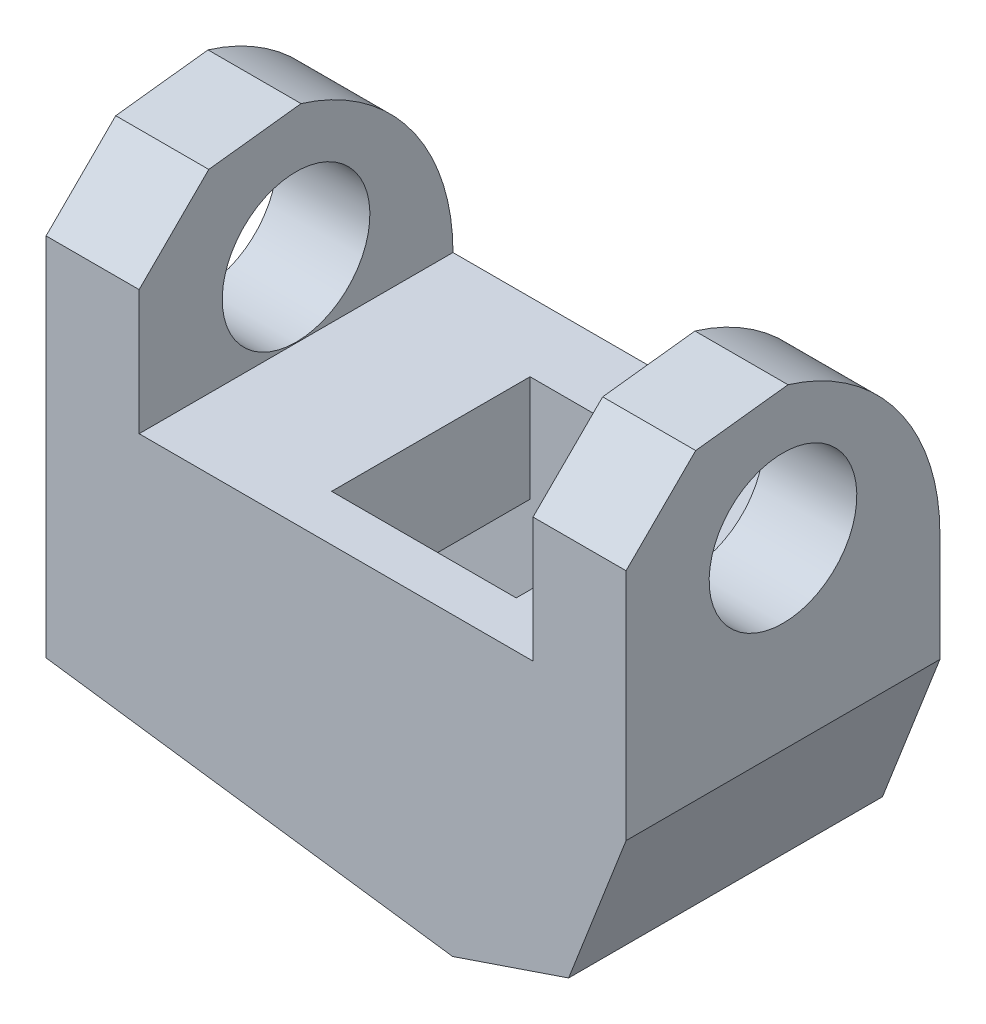
ISO-10303-21;
HEADER;
FILE_DESCRIPTION(('STEP AP214'),'2;1');
FILE_NAME('part.step','',(''),(''),'','','');
FILE_SCHEMA(('AUTOMOTIVE_DESIGN { 1 0 10303 214 1 1 1 1 }'));
ENDSEC;
DATA;
#1=APPLICATION_CONTEXT('core data for automotive mechanical design processes');
#2=APPLICATION_PROTOCOL_DEFINITION('international standard','automotive_design',2000,#1);
#3=PRODUCT_CONTEXT('',#1,'mechanical');
#4=PRODUCT('Part','Part','',(#3));
#5=PRODUCT_RELATED_PRODUCT_CATEGORY('part','',(#4));
#6=PRODUCT_DEFINITION_FORMATION('','',#4);
#7=PRODUCT_DEFINITION_CONTEXT('part definition',#1,'design');
#8=PRODUCT_DEFINITION('design','',#6,#7);
#9=PRODUCT_DEFINITION_SHAPE('','',#8);
#10=(LENGTH_UNIT() NAMED_UNIT(*) SI_UNIT(.MILLI.,.METRE.));
#11=(NAMED_UNIT(*) PLANE_ANGLE_UNIT() SI_UNIT($,.RADIAN.));
#12=(NAMED_UNIT(*) SI_UNIT($,.STERADIAN.) SOLID_ANGLE_UNIT());
#13=UNCERTAINTY_MEASURE_WITH_UNIT(LENGTH_MEASURE(1.E-05),#10,'distance_accuracy_value','');
#14=(GEOMETRIC_REPRESENTATION_CONTEXT(3) GLOBAL_UNCERTAINTY_ASSIGNED_CONTEXT((#13)) GLOBAL_UNIT_ASSIGNED_CONTEXT((#10,
#11,#12)) REPRESENTATION_CONTEXT('',''));
#15=CARTESIAN_POINT('',(0.,0.,0.));
#16=DIRECTION('',(0.,0.,1.));
#17=DIRECTION('',(1.,0.,0.));
#18=AXIS2_PLACEMENT_3D('',#15,#16,#17);
#19=CARTESIAN_POINT('',(-4.35864591467142,-16.034358049613,17.));
#20=DIRECTION('',(0.134895900916506,0.990859776111597,0.));
#21=DIRECTION('',(-0.990859776111597,0.134895900916506,0.));
#22=AXIS2_PLACEMENT_3D('',#19,#20,#21);
#23=PLANE('',#22);
#24=DIRECTION('',(0.990859776111597,-0.134895900916506,0.));
#25=VECTOR('',#24,1.);
#26=CARTESIAN_POINT('',(-4.35864591467142,-16.034358049613,0.));
#27=LINE('',#26,#25);
#28=CARTESIAN_POINT('',(-26.3755501398711,-13.0369711312482,0.));
#29=VERTEX_POINT('',#28);
#30=CARTESIAN_POINT('',(-4.35864591467142,-16.034358049613,0.));
#31=VERTEX_POINT('',#30);
#32=EDGE_CURVE('E285',#29,#31,#27,.T.);
#33=ORIENTED_EDGE('',*,*,#32,.T.);
#34=DIRECTION('',(0.,0.,-1.));
#35=VECTOR('',#34,1.);
#36=CARTESIAN_POINT('',(-4.35864591467142,-16.034358049613,17.));
#37=LINE('',#36,#35);
#38=CARTESIAN_POINT('',(-4.35864591467142,-16.034358049613,17.));
#39=VERTEX_POINT('',#38);
#40=EDGE_CURVE('E301',#39,#31,#37,.T.);
#41=ORIENTED_EDGE('',*,*,#40,.F.);
#42=DIRECTION('',(0.990859776111597,-0.134895900916506,0.));
#43=VECTOR('',#42,1.);
#44=CARTESIAN_POINT('',(-4.35864591467142,-16.034358049613,17.));
#45=LINE('',#44,#43);
#46=CARTESIAN_POINT('',(-26.3755501398711,-13.0369711312482,17.));
#47=VERTEX_POINT('',#46);
#48=EDGE_CURVE('E269',#47,#39,#45,.T.);
#49=ORIENTED_EDGE('',*,*,#48,.F.);
#50=DIRECTION('',(0.,0.,-1.));
#51=VECTOR('',#50,1.);
#52=CARTESIAN_POINT('',(-26.3755501398711,-13.0369711312482,17.));
#53=LINE('',#52,#51);
#54=EDGE_CURVE('E304',#47,#29,#53,.T.);
#55=ORIENTED_EDGE('',*,*,#54,.T.);
#56=EDGE_LOOP('',(#33,#41,#49,#55));
#57=FACE_BOUND('',#56,.T.);
#58=DIRECTION('',(-0.990859776111597,0.134895900916506,0.));
#59=VECTOR('',#58,1.);
#60=CARTESIAN_POINT('',(-20.9013469365187,-13.782230542034,3.74));
#61=LINE('',#60,#59);
#62=CARTESIAN_POINT('',(-8.3419022146401,-15.4920765279286,3.74));
#63=VERTEX_POINT('',#62);
#64=CARTESIAN_POINT('',(-20.6979236227517,-13.8099246434998,3.74));
#65=VERTEX_POINT('',#64);
#66=EDGE_CURVE('E208',#63,#65,#61,.T.);
#67=ORIENTED_EDGE('',*,*,#66,.T.);
#68=DIRECTION('',(0.,0.,1.));
#69=VECTOR('',#68,1.);
#70=CARTESIAN_POINT('',(-20.6979236227517,-13.8099246434998,3.74));
#71=LINE('',#70,#69);
#72=CARTESIAN_POINT('',(-20.6979236227517,-13.8099246434998,14.49));
#73=VERTEX_POINT('',#72);
#74=EDGE_CURVE('E204',#65,#73,#71,.T.);
#75=ORIENTED_EDGE('',*,*,#74,.T.);
#76=DIRECTION('',(0.990859776111597,-0.134895900916506,0.));
#77=VECTOR('',#76,1.);
#78=CARTESIAN_POINT('',(-20.9013469365187,-13.782230542034,14.49));
#79=LINE('',#78,#77);
#80=CARTESIAN_POINT('',(-8.3419022146401,-15.4920765279286,14.49));
#81=VERTEX_POINT('',#80);
#82=EDGE_CURVE('E207',#73,#81,#79,.T.);
#83=ORIENTED_EDGE('',*,*,#82,.T.);
#84=DIRECTION('',(0.,0.,-1.));
#85=VECTOR('',#84,1.);
#86=CARTESIAN_POINT('',(-8.3419022146401,-15.4920765279286,3.74));
#87=LINE('',#86,#85);
#88=EDGE_CURVE('E210',#81,#63,#87,.T.);
#89=ORIENTED_EDGE('',*,*,#88,.T.);
#90=EDGE_LOOP('',(#67,#75,#83,#89));
#91=FACE_BOUND('',#90,.T.);
#92=ADVANCED_FACE('F32',(#57,#91),#23,.F.);
#93=CARTESIAN_POINT('',(-21.3355501398711,11.1,17.));
#94=DIRECTION('',(-1.,0.,0.));
#95=DIRECTION('',(0.,-1.,0.));
#96=AXIS2_PLACEMENT_3D('',#93,#94,#95);
#97=PLANE('',#96);
#98=CARTESIAN_POINT('',(-21.3355501398711,4.04162085133609,8.5));
#99=DIRECTION('',(-1.,0.,0.));
#100=DIRECTION('',(0.,-1.,0.));
#101=AXIS2_PLACEMENT_3D('',#98,#99,#100);
#102=CIRCLE('',#101,4.);
#103=CARTESIAN_POINT('',(-21.3355501398711,0.0416208513360841,8.5));
#104=VERTEX_POINT('',#103);
#105=EDGE_CURVE('E415',#104,#104,#102,.T.);
#106=ORIENTED_EDGE('',*,*,#105,.T.);
#107=EDGE_LOOP('',(#106));
#108=FACE_BOUND('',#107,.T.);
#109=DIRECTION('',(0.,0.705253158861616,-0.708955557080775));
#110=VECTOR('',#109,1.);
#111=CARTESIAN_POINT('',(-21.3355501398711,8.91863795848581,14.8300297458231));
#112=LINE('',#111,#110);
#113=CARTESIAN_POINT('',(-21.3355501398711,6.76,17.));
#114=VERTEX_POINT('',#113);
#115=CARTESIAN_POINT('',(-21.3355501398711,10.5122475955982,13.2280540668032));
#116=VERTEX_POINT('',#115);
#117=EDGE_CURVE('E251',#114,#116,#112,.T.);
#118=ORIENTED_EDGE('',*,*,#117,.F.);
#119=DIRECTION('',(0.,1.,0.));
#120=VECTOR('',#119,1.);
#121=CARTESIAN_POINT('',(-21.3355501398711,11.1,17.));
#122=LINE('',#121,#120);
#123=CARTESIAN_POINT('',(-21.3355501398711,0.,17.));
#124=VERTEX_POINT('',#123);
#125=EDGE_CURVE('E263',#124,#114,#122,.T.);
#126=ORIENTED_EDGE('',*,*,#125,.F.);
#127=DIRECTION('',(0.,0.,-1.));
#128=VECTOR('',#127,1.);
#129=CARTESIAN_POINT('',(-21.3355501398711,0.,17.));
#130=LINE('',#129,#128);
#131=CARTESIAN_POINT('',(-21.3355501398711,0.,0.));
#132=VERTEX_POINT('',#131);
#133=EDGE_CURVE('E307',#124,#132,#130,.T.);
#134=ORIENTED_EDGE('',*,*,#133,.T.);
#135=CARTESIAN_POINT('',(-21.3355501398711,0.,11.6012165316514));
#136=DIRECTION('',(-1.,0.,0.));
#137=DIRECTION('',(0.,-1.,0.));
#138=AXIS2_PLACEMENT_3D('',#135,#136,#137);
#139=CIRCLE('',#138,11.6012165316514);
#140=CARTESIAN_POINT('',(-21.3355501398711,11.1,8.22805406680315));
#141=VERTEX_POINT('',#140);
#142=EDGE_CURVE('E243',#141,#132,#139,.T.);
#143=ORIENTED_EDGE('',*,*,#142,.F.);
#144=DIRECTION('',(0.,0.116746638974287,-0.993161730177018));
#145=VECTOR('',#144,1.);
#146=CARTESIAN_POINT('',(-21.3355501398711,10.0829078343711,16.8804403268307));
#147=LINE('',#146,#145);
#148=EDGE_CURVE('E257',#116,#141,#147,.T.);
#149=ORIENTED_EDGE('',*,*,#148,.F.);
#150=EDGE_LOOP('',(#118,#126,#134,#143,#149));
#151=FACE_BOUND('',#150,.T.);
#152=ADVANCED_FACE('F345',(#108,#151),#97,.F.);
#153=CARTESIAN_POINT('',(-26.3755501398711,-13.0369711312482,17.));
#154=DIRECTION('',(1.,0.,0.));
#155=DIRECTION('',(0.,1.,0.));
#156=AXIS2_PLACEMENT_3D('',#153,#154,#155);
#157=PLANE('',#156);
#158=CARTESIAN_POINT('',(-26.3755501398711,4.04162085133609,8.5));
#159=DIRECTION('',(1.,0.,0.));
#160=DIRECTION('',(0.,1.,0.));
#161=AXIS2_PLACEMENT_3D('',#158,#159,#160);
#162=CIRCLE('',#161,4.);
#163=CARTESIAN_POINT('',(-26.3755501398711,8.04162085133609,8.5));
#164=VERTEX_POINT('',#163);
#165=EDGE_CURVE('E413',#164,#164,#162,.T.);
#166=ORIENTED_EDGE('',*,*,#165,.T.);
#167=EDGE_LOOP('',(#166));
#168=FACE_BOUND('',#167,.T.);
#169=DIRECTION('',(0.,-0.705253158861616,0.708955557080775));
#170=VECTOR('',#169,1.);
#171=CARTESIAN_POINT('',(-26.3755501398711,-3.08665745321663,26.8983498796331));
#172=LINE('',#171,#170);
#173=CARTESIAN_POINT('',(-26.3755501398711,10.5122475955982,13.2280540668032));
#174=VERTEX_POINT('',#173);
#175=CARTESIAN_POINT('',(-26.3755501398711,6.76,17.));
#176=VERTEX_POINT('',#175);
#177=EDGE_CURVE('E249',#174,#176,#172,.T.);
#178=ORIENTED_EDGE('',*,*,#177,.F.);
#179=DIRECTION('',(0.,-0.116746638974287,0.993161730177018));
#180=VECTOR('',#179,1.);
#181=CARTESIAN_POINT('',(-26.3755501398711,9.75392628321622,19.6790809507654));
#182=LINE('',#181,#180);
#183=CARTESIAN_POINT('',(-26.3755501398711,11.1,8.22805406680315));
#184=VERTEX_POINT('',#183);
#185=EDGE_CURVE('E255',#184,#174,#182,.T.);
#186=ORIENTED_EDGE('',*,*,#185,.F.);
#187=CARTESIAN_POINT('',(-26.3755501398711,0.,11.6012165316514));
#188=DIRECTION('',(1.,0.,0.));
#189=DIRECTION('',(0.,1.,0.));
#190=AXIS2_PLACEMENT_3D('',#187,#188,#189);
#191=CIRCLE('',#190,11.6012165316514);
#192=CARTESIAN_POINT('',(-26.3755501398711,0.,0.));
#193=VERTEX_POINT('',#192);
#194=EDGE_CURVE('E241',#193,#184,#191,.T.);
#195=ORIENTED_EDGE('',*,*,#194,.F.);
#196=DIRECTION('',(0.,-1.,0.));
#197=VECTOR('',#196,1.);
#198=CARTESIAN_POINT('',(-26.3755501398711,-13.0369711312482,0.));
#199=LINE('',#198,#197);
#200=EDGE_CURVE('E283',#193,#29,#199,.T.);
#201=ORIENTED_EDGE('',*,*,#200,.T.);
#202=ORIENTED_EDGE('',*,*,#54,.F.);
#203=DIRECTION('',(0.,-1.,0.));
#204=VECTOR('',#203,1.);
#205=CARTESIAN_POINT('',(-26.3755501398711,-13.0369711312482,17.));
#206=LINE('',#205,#204);
#207=EDGE_CURVE('E267',#176,#47,#206,.T.);
#208=ORIENTED_EDGE('',*,*,#207,.F.);
#209=EDGE_LOOP('',(#178,#186,#195,#201,#202,#208));
#210=FACE_BOUND('',#209,.T.);
#211=ADVANCED_FACE('F376',(#168,#210),#157,.F.);
#212=CARTESIAN_POINT('',(5.04,11.1,17.));
#213=DIRECTION('',(-1.,0.,0.));
#214=DIRECTION('',(0.,-1.,0.));
#215=AXIS2_PLACEMENT_3D('',#212,#213,#214);
#216=PLANE('',#215);
#217=CARTESIAN_POINT('',(5.04,4.04162085133608,8.5));
#218=DIRECTION('',(-1.,0.,0.));
#219=DIRECTION('',(0.,-1.,0.));
#220=AXIS2_PLACEMENT_3D('',#217,#218,#219);
#221=CIRCLE('',#220,4.);
#222=CARTESIAN_POINT('',(5.04,0.0416208513360763,8.5));
#223=VERTEX_POINT('',#222);
#224=EDGE_CURVE('E416',#223,#223,#221,.T.);
#225=ORIENTED_EDGE('',*,*,#224,.T.);
#226=EDGE_LOOP('',(#225));
#227=FACE_BOUND('',#226,.T.);
#228=DIRECTION('',(0.,0.705253158861616,-0.708955557080775));
#229=VECTOR('',#228,1.);
#230=CARTESIAN_POINT('',(5.04,8.91863795848581,14.8300297458231));
#231=LINE('',#230,#229);
#232=CARTESIAN_POINT('',(5.04,6.76,17.));
#233=VERTEX_POINT('',#232);
#234=CARTESIAN_POINT('',(5.04,10.5122475955982,13.2280540668032));
#235=VERTEX_POINT('',#234);
#236=EDGE_CURVE('E247',#233,#235,#231,.T.);
#237=ORIENTED_EDGE('',*,*,#236,.F.);
#238=DIRECTION('',(0.,1.,0.));
#239=VECTOR('',#238,1.);
#240=CARTESIAN_POINT('',(5.04,11.1,17.));
#241=LINE('',#240,#239);
#242=CARTESIAN_POINT('',(5.04,-5.9,17.));
#243=VERTEX_POINT('',#242);
#244=EDGE_CURVE('E275',#243,#233,#241,.T.);
#245=ORIENTED_EDGE('',*,*,#244,.F.);
#246=DIRECTION('',(0.,0.,-1.));
#247=VECTOR('',#246,1.);
#248=CARTESIAN_POINT('',(5.04,-5.9,17.));
#249=LINE('',#248,#247);
#250=CARTESIAN_POINT('',(5.04,-5.9,0.));
#251=VERTEX_POINT('',#250);
#252=EDGE_CURVE('E295',#243,#251,#249,.T.);
#253=ORIENTED_EDGE('',*,*,#252,.T.);
#254=DIRECTION('',(0.,1.,0.));
#255=VECTOR('',#254,1.);
#256=CARTESIAN_POINT('',(5.04,11.1,0.));
#257=LINE('',#256,#255);
#258=CARTESIAN_POINT('',(5.04,0.,0.));
#259=VERTEX_POINT('',#258);
#260=EDGE_CURVE('E264',#251,#259,#257,.T.);
#261=ORIENTED_EDGE('',*,*,#260,.T.);
#262=CARTESIAN_POINT('',(5.04,0.,11.6012165316514));
#263=DIRECTION('',(-1.,0.,0.));
#264=DIRECTION('',(0.,-1.,0.));
#265=AXIS2_PLACEMENT_3D('',#262,#263,#264);
#266=CIRCLE('',#265,11.6012165316514);
#267=CARTESIAN_POINT('',(5.04,11.1,8.22805406680315));
#268=VERTEX_POINT('',#267);
#269=EDGE_CURVE('E239',#268,#259,#266,.T.);
#270=ORIENTED_EDGE('',*,*,#269,.F.);
#271=DIRECTION('',(0.,0.116746638974287,-0.993161730177018));
#272=VECTOR('',#271,1.);
#273=CARTESIAN_POINT('',(5.04,10.0829078343711,16.8804403268307));
#274=LINE('',#273,#272);
#275=EDGE_CURVE('E253',#235,#268,#274,.T.);
#276=ORIENTED_EDGE('',*,*,#275,.F.);
#277=EDGE_LOOP('',(#237,#245,#253,#261,#270,#276));
#278=FACE_BOUND('',#277,.T.);
#279=ADVANCED_FACE('F357',(#227,#278),#216,.F.);
#280=CARTESIAN_POINT('',(0.,0.,17.));
#281=DIRECTION('',(1.,0.,0.));
#282=DIRECTION('',(0.,0.,-1.));
#283=AXIS2_PLACEMENT_3D('',#280,#281,#282);
#284=PLANE('',#283);
#285=CARTESIAN_POINT('',(0.,4.04162085133608,8.5));
#286=DIRECTION('',(1.,0.,0.));
#287=DIRECTION('',(0.,0.,-1.));
#288=AXIS2_PLACEMENT_3D('',#285,#286,#287);
#289=CIRCLE('',#288,4.);
#290=CARTESIAN_POINT('',(0.,4.04162085133608,4.5));
#291=VERTEX_POINT('',#290);
#292=EDGE_CURVE('E36',#291,#291,#289,.T.);
#293=ORIENTED_EDGE('',*,*,#292,.T.);
#294=EDGE_LOOP('',(#293));
#295=FACE_BOUND('',#294,.T.);
#296=DIRECTION('',(0.,-0.705253158861616,0.708955557080775));
#297=VECTOR('',#296,1.);
#298=CARTESIAN_POINT('',(0.,3.39769755775021,20.3799536677963));
#299=LINE('',#298,#297);
#300=CARTESIAN_POINT('',(0.,10.5122475955982,13.2280540668032));
#301=VERTEX_POINT('',#300);
#302=CARTESIAN_POINT('',(0.,6.76,17.));
#303=VERTEX_POINT('',#302);
#304=EDGE_CURVE('E245',#301,#303,#299,.T.);
#305=ORIENTED_EDGE('',*,*,#304,.F.);
#306=DIRECTION('',(0.,-0.116746638974287,0.993161730177018));
#307=VECTOR('',#306,1.);
#308=CARTESIAN_POINT('',(0.,9.93161730177018,18.1674663897429));
#309=LINE('',#308,#307);
#310=CARTESIAN_POINT('',(0.,11.1,8.22805406680315));
#311=VERTEX_POINT('',#310);
#312=EDGE_CURVE('E11',#311,#301,#309,.T.);
#313=ORIENTED_EDGE('',*,*,#312,.F.);
#314=CARTESIAN_POINT('',(0.,0.,11.6012165316514));
#315=DIRECTION('',(1.,0.,0.));
#316=DIRECTION('',(0.,0.,-1.));
#317=AXIS2_PLACEMENT_3D('',#314,#315,#316);
#318=CIRCLE('',#317,11.6012165316514);
#319=CARTESIAN_POINT('',(0.,0.,0.));
#320=VERTEX_POINT('',#319);
#321=EDGE_CURVE('E237',#320,#311,#318,.T.);
#322=ORIENTED_EDGE('',*,*,#321,.F.);
#323=DIRECTION('',(0.,0.,-1.));
#324=VECTOR('',#323,1.);
#325=CARTESIAN_POINT('',(0.,0.,17.));
#326=LINE('',#325,#324);
#327=CARTESIAN_POINT('',(0.,0.,17.));
#328=VERTEX_POINT('',#327);
#329=EDGE_CURVE('E280',#328,#320,#326,.T.);
#330=ORIENTED_EDGE('',*,*,#329,.F.);
#331=DIRECTION('',(0.,-1.,0.));
#332=VECTOR('',#331,1.);
#333=CARTESIAN_POINT('',(0.,0.,17.));
#334=LINE('',#333,#332);
#335=EDGE_CURVE('E278',#303,#328,#334,.T.);
#336=ORIENTED_EDGE('',*,*,#335,.F.);
#337=EDGE_LOOP('',(#305,#313,#322,#330,#336));
#338=FACE_BOUND('',#337,.T.);
#339=ADVANCED_FACE('F332',(#295,#338),#284,.F.);
#340=CARTESIAN_POINT('',(0.,0.,17.));
#341=DIRECTION('',(0.,0.,1.));
#342=DIRECTION('',(1.,0.,0.));
#343=AXIS2_PLACEMENT_3D('',#340,#341,#342);
#344=PLANE('',#343);
#345=ORIENTED_EDGE('',*,*,#244,.T.);
#346=DIRECTION('',(-1.,0.,0.));
#347=VECTOR('',#346,1.);
#348=CARTESIAN_POINT('',(0.,6.76,17.));
#349=LINE('',#348,#347);
#350=EDGE_CURVE('E41',#233,#303,#349,.T.);
#351=ORIENTED_EDGE('',*,*,#350,.T.);
#352=ORIENTED_EDGE('',*,*,#335,.T.);
#353=DIRECTION('',(-1.,0.,0.));
#354=VECTOR('',#353,1.);
#355=CARTESIAN_POINT('',(-21.3355501398711,0.,17.));
#356=LINE('',#355,#354);
#357=EDGE_CURVE('E260',#328,#124,#356,.T.);
#358=ORIENTED_EDGE('',*,*,#357,.T.);
#359=ORIENTED_EDGE('',*,*,#125,.T.);
#360=EDGE_CURVE('E313',#114,#176,#349,.T.);
#361=ORIENTED_EDGE('',*,*,#360,.T.);
#362=ORIENTED_EDGE('',*,*,#207,.T.);
#363=ORIENTED_EDGE('',*,*,#48,.T.);
#364=DIRECTION('',(0.946930129495106,0.321439465303159,0.));
#365=VECTOR('',#364,1.);
#366=CARTESIAN_POINT('',(1.92897014517608,-13.9,17.));
#367=LINE('',#366,#365);
#368=CARTESIAN_POINT('',(1.92897014517608,-13.9,17.));
#369=VERTEX_POINT('',#368);
#370=EDGE_CURVE('E271',#39,#369,#367,.T.);
#371=ORIENTED_EDGE('',*,*,#370,.T.);
#372=DIRECTION('',(0.362438038283702,0.932007869282798,0.));
#373=VECTOR('',#372,1.);
#374=CARTESIAN_POINT('',(5.04,-5.9,17.));
#375=LINE('',#374,#373);
#376=EDGE_CURVE('E273',#369,#243,#375,.T.);
#377=ORIENTED_EDGE('',*,*,#376,.T.);
#378=EDGE_LOOP('',(#345,#351,#352,#358,#359,#361,#362,#363,#371,#377));
#379=FACE_BOUND('',#378,.T.);
#380=ADVANCED_FACE('F347',(#379),#344,.T.);
#381=CARTESIAN_POINT('',(0.,0.,0.));
#382=DIRECTION('',(0.,0.,1.));
#383=DIRECTION('',(1.,0.,0.));
#384=AXIS2_PLACEMENT_3D('',#381,#382,#383);
#385=PLANE('',#384);
#386=DIRECTION('',(-1.,0.,0.));
#387=VECTOR('',#386,1.);
#388=CARTESIAN_POINT('',(31.,0.,0.));
#389=LINE('',#388,#387);
#390=EDGE_CURVE('E312',#259,#320,#389,.T.);
#391=ORIENTED_EDGE('',*,*,#390,.F.);
#392=ORIENTED_EDGE('',*,*,#260,.F.);
#393=DIRECTION('',(0.362438038283702,0.932007869282798,0.));
#394=VECTOR('',#393,1.);
#395=CARTESIAN_POINT('',(5.04,-5.9,0.));
#396=LINE('',#395,#394);
#397=CARTESIAN_POINT('',(1.92897014517608,-13.9,0.));
#398=VERTEX_POINT('',#397);
#399=EDGE_CURVE('E289',#398,#251,#396,.T.);
#400=ORIENTED_EDGE('',*,*,#399,.F.);
#401=DIRECTION('',(0.946930129495106,0.321439465303159,0.));
#402=VECTOR('',#401,1.);
#403=CARTESIAN_POINT('',(1.92897014517608,-13.9,0.));
#404=LINE('',#403,#402);
#405=EDGE_CURVE('E287',#31,#398,#404,.T.);
#406=ORIENTED_EDGE('',*,*,#405,.F.);
#407=ORIENTED_EDGE('',*,*,#32,.F.);
#408=ORIENTED_EDGE('',*,*,#200,.F.);
#409=EDGE_CURVE('E310',#132,#193,#389,.T.);
#410=ORIENTED_EDGE('',*,*,#409,.F.);
#411=DIRECTION('',(-1.,0.,0.));
#412=VECTOR('',#411,1.);
#413=CARTESIAN_POINT('',(-21.3355501398711,0.,0.));
#414=LINE('',#413,#412);
#415=EDGE_CURVE('E259',#320,#132,#414,.T.);
#416=ORIENTED_EDGE('',*,*,#415,.F.);
#417=EDGE_LOOP('',(#391,#392,#400,#406,#407,#408,#410,#416));
#418=FACE_BOUND('',#417,.T.);
#419=ADVANCED_FACE('F337',(#418),#385,.F.);
#420=CARTESIAN_POINT('',(-21.3355501398711,0.,17.));
#421=DIRECTION('',(0.,-1.,0.));
#422=DIRECTION('',(0.,0.,-1.));
#423=AXIS2_PLACEMENT_3D('',#420,#421,#422);
#424=PLANE('',#423);
#425=DIRECTION('',(-1.,0.,0.));
#426=VECTOR('',#425,1.);
#427=CARTESIAN_POINT('',(-3.42,0.,3.74));
#428=LINE('',#427,#426);
#429=CARTESIAN_POINT('',(-3.42,0.,3.74));
#430=VERTEX_POINT('',#429);
#431=CARTESIAN_POINT('',(-13.42,0.,3.74));
#432=VERTEX_POINT('',#431);
#433=EDGE_CURVE('E186',#430,#432,#428,.T.);
#434=ORIENTED_EDGE('',*,*,#433,.F.);
#435=DIRECTION('',(0.,0.,-1.));
#436=VECTOR('',#435,1.);
#437=CARTESIAN_POINT('',(-3.42,0.,14.49));
#438=LINE('',#437,#436);
#439=CARTESIAN_POINT('',(-3.42,0.,14.49));
#440=VERTEX_POINT('',#439);
#441=EDGE_CURVE('E48',#440,#430,#438,.T.);
#442=ORIENTED_EDGE('',*,*,#441,.F.);
#443=DIRECTION('',(1.,0.,0.));
#444=VECTOR('',#443,1.);
#445=CARTESIAN_POINT('',(-3.42,0.,14.49));
#446=LINE('',#445,#444);
#447=CARTESIAN_POINT('',(-13.42,0.,14.49));
#448=VERTEX_POINT('',#447);
#449=EDGE_CURVE('E193',#448,#440,#446,.T.);
#450=ORIENTED_EDGE('',*,*,#449,.F.);
#451=DIRECTION('',(0.,0.,1.));
#452=VECTOR('',#451,1.);
#453=CARTESIAN_POINT('',(-13.42,0.,14.49));
#454=LINE('',#453,#452);
#455=EDGE_CURVE('E175',#432,#448,#454,.T.);
#456=ORIENTED_EDGE('',*,*,#455,.F.);
#457=EDGE_LOOP('',(#434,#442,#450,#456));
#458=FACE_BOUND('',#457,.T.);
#459=ORIENTED_EDGE('',*,*,#415,.T.);
#460=ORIENTED_EDGE('',*,*,#133,.F.);
#461=ORIENTED_EDGE('',*,*,#357,.F.);
#462=ORIENTED_EDGE('',*,*,#329,.T.);
#463=EDGE_LOOP('',(#459,#460,#461,#462));
#464=FACE_BOUND('',#463,.T.);
#465=ADVANCED_FACE('F34',(#458,#464),#424,.F.);
#466=CARTESIAN_POINT('',(1.92897014517608,-13.9,17.));
#467=DIRECTION('',(-0.321439465303159,0.946930129495106,0.));
#468=DIRECTION('',(-0.946930129495106,-0.321439465303159,0.));
#469=AXIS2_PLACEMENT_3D('',#466,#467,#468);
#470=PLANE('',#469);
#471=ORIENTED_EDGE('',*,*,#405,.T.);
#472=DIRECTION('',(0.,0.,-1.));
#473=VECTOR('',#472,1.);
#474=CARTESIAN_POINT('',(1.92897014517608,-13.9,17.));
#475=LINE('',#474,#473);
#476=EDGE_CURVE('E298',#369,#398,#475,.T.);
#477=ORIENTED_EDGE('',*,*,#476,.F.);
#478=ORIENTED_EDGE('',*,*,#370,.F.);
#479=ORIENTED_EDGE('',*,*,#40,.T.);
#480=EDGE_LOOP('',(#471,#477,#478,#479));
#481=FACE_BOUND('',#480,.T.);
#482=ADVANCED_FACE('F368',(#481),#470,.F.);
#483=CARTESIAN_POINT('',(5.04,-5.9,17.));
#484=DIRECTION('',(-0.932007869282798,0.362438038283702,0.));
#485=DIRECTION('',(-0.362438038283702,-0.932007869282798,0.));
#486=AXIS2_PLACEMENT_3D('',#483,#484,#485);
#487=PLANE('',#486);
#488=ORIENTED_EDGE('',*,*,#399,.T.);
#489=ORIENTED_EDGE('',*,*,#252,.F.);
#490=ORIENTED_EDGE('',*,*,#376,.F.);
#491=ORIENTED_EDGE('',*,*,#476,.T.);
#492=EDGE_LOOP('',(#488,#489,#490,#491));
#493=FACE_BOUND('',#492,.T.);
#494=ADVANCED_FACE('F363',(#493),#487,.F.);
#495=CARTESIAN_POINT('',(31.,0.,11.6012165316514));
#496=DIRECTION('',(-1.,0.,0.));
#497=DIRECTION('',(0.,-1.,0.));
#498=AXIS2_PLACEMENT_3D('',#495,#496,#497);
#499=CYLINDRICAL_SURFACE('',#498,11.6012165316514);
#500=ORIENTED_EDGE('',*,*,#142,.T.);
#501=ORIENTED_EDGE('',*,*,#409,.T.);
#502=ORIENTED_EDGE('',*,*,#194,.T.);
#503=DIRECTION('',(-1.,0.,0.));
#504=VECTOR('',#503,1.);
#505=CARTESIAN_POINT('',(31.,11.1,8.22805406680315));
#506=LINE('',#505,#504);
#507=EDGE_CURVE('E213',#141,#184,#506,.T.);
#508=ORIENTED_EDGE('',*,*,#507,.F.);
#509=EDGE_LOOP('',(#500,#501,#502,#508));
#510=FACE_BOUND('',#509,.T.);
#511=ADVANCED_FACE('F379',(#510),#499,.T.);
#512=CARTESIAN_POINT('',(31.,11.8975810418533,11.8354479752292));
#513=DIRECTION('',(0.,0.708955557080775,0.705253158861616));
#514=DIRECTION('',(0.,-0.705253158861616,0.708955557080775));
#515=AXIS2_PLACEMENT_3D('',#512,#513,#514);
#516=PLANE('',#515);
#517=ORIENTED_EDGE('',*,*,#117,.T.);
#518=DIRECTION('',(-1.,0.,0.));
#519=VECTOR('',#518,1.);
#520=CARTESIAN_POINT('',(31.,10.5122475955982,13.2280540668032));
#521=LINE('',#520,#519);
#522=EDGE_CURVE('E230',#116,#174,#521,.T.);
#523=ORIENTED_EDGE('',*,*,#522,.T.);
#524=ORIENTED_EDGE('',*,*,#177,.T.);
#525=ORIENTED_EDGE('',*,*,#360,.F.);
#526=EDGE_LOOP('',(#517,#523,#524,#525));
#527=FACE_BOUND('',#526,.T.);
#528=ADVANCED_FACE('F384',(#527),#516,.T.);
#529=CARTESIAN_POINT('',(31.,11.9027382990231,1.39917261084334));
#530=DIRECTION('',(0.,0.993161730177018,0.116746638974287));
#531=DIRECTION('',(0.,-0.116746638974287,0.993161730177018));
#532=AXIS2_PLACEMENT_3D('',#529,#530,#531);
#533=PLANE('',#532);
#534=ORIENTED_EDGE('',*,*,#148,.T.);
#535=ORIENTED_EDGE('',*,*,#507,.T.);
#536=ORIENTED_EDGE('',*,*,#185,.T.);
#537=ORIENTED_EDGE('',*,*,#522,.F.);
#538=EDGE_LOOP('',(#534,#535,#536,#537));
#539=FACE_BOUND('',#538,.T.);
#540=ADVANCED_FACE('F381',(#539),#533,.T.);
#541=ORIENTED_EDGE('',*,*,#275,.T.);
#542=EDGE_CURVE('E234',#268,#311,#506,.T.);
#543=ORIENTED_EDGE('',*,*,#542,.T.);
#544=ORIENTED_EDGE('',*,*,#312,.T.);
#545=EDGE_CURVE('E233',#235,#301,#521,.T.);
#546=ORIENTED_EDGE('',*,*,#545,.F.);
#547=EDGE_LOOP('',(#541,#543,#544,#546));
#548=FACE_BOUND('',#547,.T.);
#549=ADVANCED_FACE('F355',(#548),#533,.T.);
#550=ORIENTED_EDGE('',*,*,#236,.T.);
#551=ORIENTED_EDGE('',*,*,#545,.T.);
#552=ORIENTED_EDGE('',*,*,#304,.T.);
#553=ORIENTED_EDGE('',*,*,#350,.F.);
#554=EDGE_LOOP('',(#550,#551,#552,#553));
#555=FACE_BOUND('',#554,.T.);
#556=ADVANCED_FACE('F350',(#555),#516,.T.);
#557=ORIENTED_EDGE('',*,*,#269,.T.);
#558=ORIENTED_EDGE('',*,*,#390,.T.);
#559=ORIENTED_EDGE('',*,*,#321,.T.);
#560=ORIENTED_EDGE('',*,*,#542,.F.);
#561=EDGE_LOOP('',(#557,#558,#559,#560));
#562=FACE_BOUND('',#561,.T.);
#563=ADVANCED_FACE('F321',(#562),#499,.T.);
#564=CARTESIAN_POINT('',(0.812934287353596,-7.68273805723592,0.));
#565=DIRECTION('',(0.134895900916506,0.990859776111597,0.));
#566=DIRECTION('',(-0.990859776111597,0.134895900916506,0.));
#567=AXIS2_PLACEMENT_3D('',#564,#565,#566);
#568=PLANE('',#567);
#569=DIRECTION('',(0.990859776111597,-0.134895900916506,0.));
#570=VECTOR('',#569,1.);
#571=CARTESIAN_POINT('',(-17.6624763215526,-5.16749097689619,3.74));
#572=LINE('',#571,#570);
#573=CARTESIAN_POINT('',(-17.6624763215526,-5.16749097689618,3.74));
#574=VERTEX_POINT('',#573);
#575=CARTESIAN_POINT('',(-13.42,-5.74506277798253,3.74));
#576=VERTEX_POINT('',#575);
#577=EDGE_CURVE('E226',#574,#576,#572,.T.);
#578=ORIENTED_EDGE('',*,*,#577,.T.);
#579=DIRECTION('',(0.,0.,1.));
#580=VECTOR('',#579,1.);
#581=CARTESIAN_POINT('',(-13.42,-5.74506277798253,0.));
#582=LINE('',#581,#580);
#583=CARTESIAN_POINT('',(-13.42,-5.74506277798253,14.49));
#584=VERTEX_POINT('',#583);
#585=EDGE_CURVE('E178',#576,#584,#582,.T.);
#586=ORIENTED_EDGE('',*,*,#585,.T.);
#587=DIRECTION('',(-0.990859776111597,0.134895900916506,0.));
#588=VECTOR('',#587,1.);
#589=CARTESIAN_POINT('',(-17.6624763215526,-5.16749097689619,14.49));
#590=LINE('',#589,#588);
#591=CARTESIAN_POINT('',(-17.6624763215526,-5.16749097689618,14.49));
#592=VERTEX_POINT('',#591);
#593=EDGE_CURVE('E218',#584,#592,#590,.T.);
#594=ORIENTED_EDGE('',*,*,#593,.T.);
#595=DIRECTION('',(0.,0.,-1.));
#596=VECTOR('',#595,1.);
#597=CARTESIAN_POINT('',(-17.6624763215526,-5.16749097689619,3.74));
#598=LINE('',#597,#596);
#599=EDGE_CURVE('E220',#592,#574,#598,.T.);
#600=ORIENTED_EDGE('',*,*,#599,.T.);
#601=EDGE_LOOP('',(#578,#586,#594,#600));
#602=FACE_BOUND('',#601,.T.);
#603=ADVANCED_FACE('F431',(#602),#568,.F.);
#604=CARTESIAN_POINT('',(-21.0362620788734,-14.7732316535531,3.74));
#605=DIRECTION('',(0.,0.,1.));
#606=DIRECTION('',(1.,0.,0.));
#607=AXIS2_PLACEMENT_3D('',#604,#605,#606);
#608=PLANE('',#607);
#609=DIRECTION('',(0.331380709737887,0.943497125175066,0.));
#610=VECTOR('',#609,1.);
#611=CARTESIAN_POINT('',(-21.0362620788734,-14.7732316535531,3.74));
#612=LINE('',#611,#610);
#613=EDGE_CURVE('E221',#65,#574,#612,.T.);
#614=ORIENTED_EDGE('',*,*,#613,.F.);
#615=ORIENTED_EDGE('',*,*,#66,.F.);
#616=DIRECTION('',(0.331380709737887,0.943497125175066,0.));
#617=VECTOR('',#616,1.);
#618=CARTESIAN_POINT('',(-8.68024067076177,-16.455383537982,3.74));
#619=LINE('',#618,#617);
#620=CARTESIAN_POINT('',(-3.42,-1.4785855387312,3.74));
#621=VERTEX_POINT('',#620);
#622=EDGE_CURVE('E56',#63,#621,#619,.T.);
#623=ORIENTED_EDGE('',*,*,#622,.T.);
#624=DIRECTION('',(0.,1.,0.));
#625=VECTOR('',#624,1.);
#626=CARTESIAN_POINT('',(-3.42,-45.2082963652625,3.74));
#627=LINE('',#626,#625);
#628=EDGE_CURVE('E183',#621,#430,#627,.T.);
#629=ORIENTED_EDGE('',*,*,#628,.T.);
#630=ORIENTED_EDGE('',*,*,#433,.T.);
#631=DIRECTION('',(0.,1.,0.));
#632=VECTOR('',#631,1.);
#633=CARTESIAN_POINT('',(-13.42,-45.2082963652625,3.74));
#634=LINE('',#633,#632);
#635=EDGE_CURVE('E171',#576,#432,#634,.T.);
#636=ORIENTED_EDGE('',*,*,#635,.F.);
#637=ORIENTED_EDGE('',*,*,#577,.F.);
#638=EDGE_LOOP('',(#614,#615,#623,#629,#630,#636,#637));
#639=FACE_BOUND('',#638,.T.);
#640=ADVANCED_FACE('F188',(#639),#608,.T.);
#641=CARTESIAN_POINT('',(-21.0362620788734,-14.7732316535531,3.74));
#642=DIRECTION('',(0.943497125175066,-0.331380709737887,0.));
#643=DIRECTION('',(0.331380709737887,0.943497125175066,0.));
#644=AXIS2_PLACEMENT_3D('',#641,#642,#643);
#645=PLANE('',#644);
#646=ORIENTED_EDGE('',*,*,#613,.T.);
#647=ORIENTED_EDGE('',*,*,#599,.F.);
#648=DIRECTION('',(0.331380709737887,0.943497125175066,0.));
#649=VECTOR('',#648,1.);
#650=CARTESIAN_POINT('',(-21.0362620788734,-14.7732316535531,14.49));
#651=LINE('',#650,#649);
#652=EDGE_CURVE('E216',#73,#592,#651,.T.);
#653=ORIENTED_EDGE('',*,*,#652,.F.);
#654=ORIENTED_EDGE('',*,*,#74,.F.);
#655=EDGE_LOOP('',(#646,#647,#653,#654));
#656=FACE_BOUND('',#655,.T.);
#657=ADVANCED_FACE('F435',(#656),#645,.T.);
#658=CARTESIAN_POINT('',(-21.0362620788734,-14.7732316535531,14.49));
#659=DIRECTION('',(0.,0.,-1.));
#660=DIRECTION('',(-1.,0.,0.));
#661=AXIS2_PLACEMENT_3D('',#658,#659,#660);
#662=PLANE('',#661);
#663=ORIENTED_EDGE('',*,*,#593,.F.);
#664=DIRECTION('',(0.,1.,0.));
#665=VECTOR('',#664,1.);
#666=CARTESIAN_POINT('',(-13.42,-45.2082963652625,14.49));
#667=LINE('',#666,#665);
#668=EDGE_CURVE('E182',#584,#448,#667,.T.);
#669=ORIENTED_EDGE('',*,*,#668,.T.);
#670=ORIENTED_EDGE('',*,*,#449,.T.);
#671=DIRECTION('',(0.,1.,0.));
#672=VECTOR('',#671,1.);
#673=CARTESIAN_POINT('',(-3.42,-45.2082963652625,14.49));
#674=LINE('',#673,#672);
#675=CARTESIAN_POINT('',(-3.42,-1.4785855387312,14.49));
#676=VERTEX_POINT('',#675);
#677=EDGE_CURVE('E198',#676,#440,#674,.T.);
#678=ORIENTED_EDGE('',*,*,#677,.F.);
#679=DIRECTION('',(0.331380709737887,0.943497125175066,0.));
#680=VECTOR('',#679,1.);
#681=CARTESIAN_POINT('',(-8.68024067076177,-16.455383537982,14.49));
#682=LINE('',#681,#680);
#683=EDGE_CURVE('E214',#81,#676,#682,.T.);
#684=ORIENTED_EDGE('',*,*,#683,.F.);
#685=ORIENTED_EDGE('',*,*,#82,.F.);
#686=ORIENTED_EDGE('',*,*,#652,.T.);
#687=EDGE_LOOP('',(#663,#669,#670,#678,#684,#685,#686));
#688=FACE_BOUND('',#687,.T.);
#689=ADVANCED_FACE('F429',(#688),#662,.T.);
#690=CARTESIAN_POINT('',(-8.68024067076177,-16.455383537982,3.74));
#691=DIRECTION('',(-0.943497125175066,0.331380709737887,0.));
#692=DIRECTION('',(-0.331380709737887,-0.943497125175066,0.));
#693=AXIS2_PLACEMENT_3D('',#690,#691,#692);
#694=PLANE('',#693);
#695=ORIENTED_EDGE('',*,*,#683,.T.);
#696=DIRECTION('',(0.,0.,1.));
#697=VECTOR('',#696,1.);
#698=CARTESIAN_POINT('',(-3.42,-1.4785855387312,14.49));
#699=LINE('',#698,#697);
#700=EDGE_CURVE('E200',#621,#676,#699,.T.);
#701=ORIENTED_EDGE('',*,*,#700,.F.);
#702=ORIENTED_EDGE('',*,*,#622,.F.);
#703=ORIENTED_EDGE('',*,*,#88,.F.);
#704=EDGE_LOOP('',(#695,#701,#702,#703));
#705=FACE_BOUND('',#704,.T.);
#706=ADVANCED_FACE('F437',(#705),#694,.T.);
#707=CARTESIAN_POINT('',(-13.42,-45.2082963652625,14.49));
#708=DIRECTION('',(-1.,0.,0.));
#709=DIRECTION('',(0.,0.,1.));
#710=AXIS2_PLACEMENT_3D('',#707,#708,#709);
#711=PLANE('',#710);
#712=ORIENTED_EDGE('',*,*,#635,.T.);
#713=ORIENTED_EDGE('',*,*,#455,.T.);
#714=ORIENTED_EDGE('',*,*,#668,.F.);
#715=ORIENTED_EDGE('',*,*,#585,.F.);
#716=EDGE_LOOP('',(#712,#713,#714,#715));
#717=FACE_BOUND('',#716,.T.);
#718=ADVANCED_FACE('F173',(#717),#711,.F.);
#719=CARTESIAN_POINT('',(-3.42,-45.2082963652625,14.49));
#720=DIRECTION('',(1.,0.,0.));
#721=DIRECTION('',(0.,0.,-1.));
#722=AXIS2_PLACEMENT_3D('',#719,#720,#721);
#723=PLANE('',#722);
#724=ORIENTED_EDGE('',*,*,#700,.T.);
#725=ORIENTED_EDGE('',*,*,#677,.T.);
#726=ORIENTED_EDGE('',*,*,#441,.T.);
#727=ORIENTED_EDGE('',*,*,#628,.F.);
#728=EDGE_LOOP('',(#724,#725,#726,#727));
#729=FACE_BOUND('',#728,.T.);
#730=ADVANCED_FACE('F425',(#729),#723,.F.);
#731=CARTESIAN_POINT('',(20.3322249300645,4.04162085133607,8.5));
#732=DIRECTION('',(-1.,0.,0.));
#733=DIRECTION('',(0.,-1.,0.));
#734=AXIS2_PLACEMENT_3D('',#731,#732,#733);
#735=CYLINDRICAL_SURFACE('',#734,4.);
#736=ORIENTED_EDGE('',*,*,#292,.F.);
#737=EDGE_LOOP('',(#736));
#738=FACE_BOUND('',#737,.T.);
#739=ORIENTED_EDGE('',*,*,#224,.F.);
#740=EDGE_LOOP('',(#739));
#741=FACE_BOUND('',#740,.T.);
#742=ADVANCED_FACE('F511',(#738,#741),#735,.F.);
#743=ORIENTED_EDGE('',*,*,#165,.F.);
#744=EDGE_LOOP('',(#743));
#745=FACE_BOUND('',#744,.T.);
#746=ORIENTED_EDGE('',*,*,#105,.F.);
#747=EDGE_LOOP('',(#746));
#748=FACE_BOUND('',#747,.T.);
#749=ADVANCED_FACE('F594',(#745,#748),#735,.F.);
#750=CLOSED_SHELL('',(#92,#152,#211,#279,#339,#380,#419,#465,#482,#494,#511,#528,#540,#549,#556,
#563,#603,#640,#657,#689,#706,#718,#730,#742,#749));
#751=MANIFOLD_SOLID_BREP('B2',#750);
#752=ADVANCED_BREP_SHAPE_REPRESENTATION('',(#18,#751),#14);
#753=SHAPE_DEFINITION_REPRESENTATION(#9,#752);
ENDSEC;
END-ISO-10303-21;
